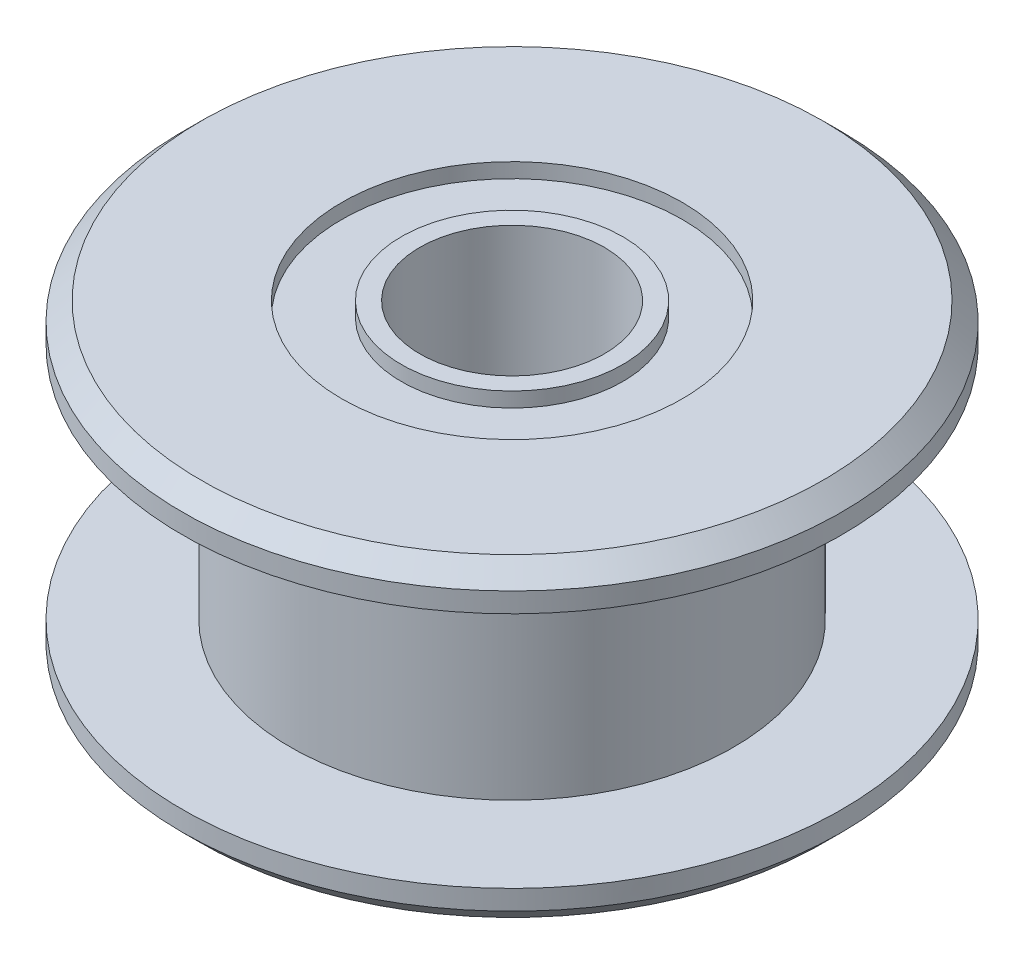
ISO-10303-21;
HEADER;
FILE_DESCRIPTION(('STEP AP214'),'2;1');
FILE_NAME('part.step','',(''),(''),'','','');
FILE_SCHEMA(('AUTOMOTIVE_DESIGN { 1 0 10303 214 1 1 1 1 }'));
ENDSEC;
DATA;
#1=APPLICATION_CONTEXT('core data for automotive mechanical design processes');
#2=APPLICATION_PROTOCOL_DEFINITION('international standard','automotive_design',2000,#1);
#3=PRODUCT_CONTEXT('',#1,'mechanical');
#4=PRODUCT('Part','Part','',(#3));
#5=PRODUCT_RELATED_PRODUCT_CATEGORY('part','',(#4));
#6=PRODUCT_DEFINITION_FORMATION('','',#4);
#7=PRODUCT_DEFINITION_CONTEXT('part definition',#1,'design');
#8=PRODUCT_DEFINITION('design','',#6,#7);
#9=PRODUCT_DEFINITION_SHAPE('','',#8);
#10=(LENGTH_UNIT() NAMED_UNIT(*) SI_UNIT(.MILLI.,.METRE.));
#11=(NAMED_UNIT(*) PLANE_ANGLE_UNIT() SI_UNIT($,.RADIAN.));
#12=(NAMED_UNIT(*) SI_UNIT($,.STERADIAN.) SOLID_ANGLE_UNIT());
#13=UNCERTAINTY_MEASURE_WITH_UNIT(LENGTH_MEASURE(1.E-05),#10,'distance_accuracy_value','');
#14=(GEOMETRIC_REPRESENTATION_CONTEXT(3) GLOBAL_UNCERTAINTY_ASSIGNED_CONTEXT((#13)) GLOBAL_UNIT_ASSIGNED_CONTEXT((#10,
#11,#12)) REPRESENTATION_CONTEXT('',''));
#15=CARTESIAN_POINT('',(0.,0.,0.));
#16=DIRECTION('',(0.,0.,1.));
#17=DIRECTION('',(1.,0.,0.));
#18=AXIS2_PLACEMENT_3D('',#15,#16,#17);
#19=CARTESIAN_POINT('',(0.,0.,0.));
#20=DIRECTION('',(0.,-1.,0.));
#21=DIRECTION('',(0.,0.,-1.));
#22=AXIS2_PLACEMENT_3D('',#19,#20,#21);
#23=CYLINDRICAL_SURFACE('',#22,4.61);
#24=CARTESIAN_POINT('',(0.,3.855,0.));
#25=DIRECTION('',(0.,-1.,0.));
#26=DIRECTION('',(0.,0.,-1.));
#27=AXIS2_PLACEMENT_3D('',#24,#25,#26);
#28=CIRCLE('',#27,4.61);
#29=CARTESIAN_POINT('',(0.,3.855,-4.61));
#30=VERTEX_POINT('',#29);
#31=EDGE_CURVE('E68',#30,#30,#28,.F.);
#32=ORIENTED_EDGE('',*,*,#31,.F.);
#33=EDGE_LOOP('',(#32));
#34=FACE_BOUND('',#33,.T.);
#35=CARTESIAN_POINT('',(0.,4.255,0.));
#36=DIRECTION('',(0.,-1.,0.));
#37=DIRECTION('',(0.,0.,-1.));
#38=AXIS2_PLACEMENT_3D('',#35,#36,#37);
#39=CIRCLE('',#38,4.61);
#40=CARTESIAN_POINT('',(0.,4.255,-4.61));
#41=VERTEX_POINT('',#40);
#42=EDGE_CURVE('E18',#41,#41,#39,.T.);
#43=ORIENTED_EDGE('',*,*,#42,.F.);
#44=EDGE_LOOP('',(#43));
#45=FACE_BOUND('',#44,.T.);
#46=ADVANCED_FACE('F15',(#34,#45),#23,.F.);
#47=CARTESIAN_POINT('',(4.61,4.255,0.));
#48=DIRECTION('',(0.,1.,0.));
#49=DIRECTION('',(0.,0.,1.));
#50=AXIS2_PLACEMENT_3D('',#47,#48,#49);
#51=PLANE('',#50);
#52=ORIENTED_EDGE('',*,*,#42,.T.);
#53=EDGE_LOOP('',(#52));
#54=FACE_BOUND('',#53,.T.);
#55=CARTESIAN_POINT('',(0.,4.255,0.));
#56=DIRECTION('',(0.,-1.,0.));
#57=DIRECTION('',(0.,0.,-1.));
#58=AXIS2_PLACEMENT_3D('',#55,#56,#57);
#59=CIRCLE('',#58,8.42499999999999);
#60=CARTESIAN_POINT('',(0.,4.255,-8.42499999999999));
#61=VERTEX_POINT('',#60);
#62=EDGE_CURVE('E66',#61,#61,#59,.T.);
#63=ORIENTED_EDGE('',*,*,#62,.F.);
#64=EDGE_LOOP('',(#63));
#65=FACE_BOUND('',#64,.T.);
#66=ADVANCED_FACE('F75',(#54,#65),#51,.T.);
#67=CARTESIAN_POINT('',(3.,3.855,0.));
#68=DIRECTION('',(0.,1.,0.));
#69=DIRECTION('',(0.,0.,1.));
#70=AXIS2_PLACEMENT_3D('',#67,#68,#69);
#71=PLANE('',#70);
#72=ORIENTED_EDGE('',*,*,#31,.T.);
#73=EDGE_LOOP('',(#72));
#74=FACE_BOUND('',#73,.T.);
#75=CARTESIAN_POINT('',(0.,3.855,0.));
#76=DIRECTION('',(0.,-1.,0.));
#77=DIRECTION('',(0.,0.,-1.));
#78=AXIS2_PLACEMENT_3D('',#75,#76,#77);
#79=CIRCLE('',#78,3.);
#80=CARTESIAN_POINT('',(0.,3.855,-3.));
#81=VERTEX_POINT('',#80);
#82=EDGE_CURVE('E63',#81,#81,#79,.F.);
#83=ORIENTED_EDGE('',*,*,#82,.F.);
#84=EDGE_LOOP('',(#83));
#85=FACE_BOUND('',#84,.T.);
#86=ADVANCED_FACE('F84',(#74,#85),#71,.T.);
#87=CARTESIAN_POINT('',(0.,3.75499999999999,0.));
#88=DIRECTION('',(0.,-1.,0.));
#89=DIRECTION('',(0.,0.,-1.));
#90=AXIS2_PLACEMENT_3D('',#87,#88,#89);
#91=CONICAL_SURFACE('',#90,8.925,0.785398163397452);
#92=ORIENTED_EDGE('',*,*,#62,.T.);
#93=EDGE_LOOP('',(#92));
#94=FACE_BOUND('',#93,.T.);
#95=CARTESIAN_POINT('',(0.,3.75499999999999,0.));
#96=DIRECTION('',(0.,-1.,0.));
#97=DIRECTION('',(0.,0.,-1.));
#98=AXIS2_PLACEMENT_3D('',#95,#96,#97);
#99=CIRCLE('',#98,8.925);
#100=CARTESIAN_POINT('',(0.,3.75499999999999,-8.925));
#101=VERTEX_POINT('',#100);
#102=EDGE_CURVE('E30',#101,#101,#99,.T.);
#103=ORIENTED_EDGE('',*,*,#102,.F.);
#104=EDGE_LOOP('',(#103));
#105=FACE_BOUND('',#104,.T.);
#106=ADVANCED_FACE('F143',(#94,#105),#91,.T.);
#107=CARTESIAN_POINT('',(0.,0.,0.));
#108=DIRECTION('',(0.,-1.,0.));
#109=DIRECTION('',(0.,0.,-1.));
#110=AXIS2_PLACEMENT_3D('',#107,#108,#109);
#111=CYLINDRICAL_SURFACE('',#110,3.);
#112=CARTESIAN_POINT('',(0.,4.255,0.));
#113=DIRECTION('',(0.,-1.,0.));
#114=DIRECTION('',(0.,0.,-1.));
#115=AXIS2_PLACEMENT_3D('',#112,#113,#114);
#116=CIRCLE('',#115,3.);
#117=CARTESIAN_POINT('',(0.,4.255,-3.));
#118=VERTEX_POINT('',#117);
#119=EDGE_CURVE('E60',#118,#118,#116,.F.);
#120=ORIENTED_EDGE('',*,*,#119,.F.);
#121=EDGE_LOOP('',(#120));
#122=FACE_BOUND('',#121,.T.);
#123=ORIENTED_EDGE('',*,*,#82,.T.);
#124=EDGE_LOOP('',(#123));
#125=FACE_BOUND('',#124,.T.);
#126=ADVANCED_FACE('F139',(#122,#125),#111,.T.);
#127=CARTESIAN_POINT('',(0.,0.,0.));
#128=DIRECTION('',(0.,-1.,0.));
#129=DIRECTION('',(0.,0.,-1.));
#130=AXIS2_PLACEMENT_3D('',#127,#128,#129);
#131=CYLINDRICAL_SURFACE('',#130,8.925);
#132=ORIENTED_EDGE('',*,*,#102,.T.);
#133=EDGE_LOOP('',(#132));
#134=FACE_BOUND('',#133,.T.);
#135=CARTESIAN_POINT('',(0.,3.22,0.));
#136=DIRECTION('',(0.,-1.,0.));
#137=DIRECTION('',(0.,0.,-1.));
#138=AXIS2_PLACEMENT_3D('',#135,#136,#137);
#139=CIRCLE('',#138,8.925);
#140=CARTESIAN_POINT('',(0.,3.22,-8.925));
#141=VERTEX_POINT('',#140);
#142=EDGE_CURVE('E57',#141,#141,#139,.T.);
#143=ORIENTED_EDGE('',*,*,#142,.F.);
#144=EDGE_LOOP('',(#143));
#145=FACE_BOUND('',#144,.T.);
#146=ADVANCED_FACE('F135',(#134,#145),#131,.T.);
#147=CARTESIAN_POINT('',(2.5,4.255,0.));
#148=DIRECTION('',(0.,1.,0.));
#149=DIRECTION('',(0.,0.,1.));
#150=AXIS2_PLACEMENT_3D('',#147,#148,#149);
#151=PLANE('',#150);
#152=ORIENTED_EDGE('',*,*,#119,.T.);
#153=EDGE_LOOP('',(#152));
#154=FACE_BOUND('',#153,.T.);
#155=CARTESIAN_POINT('',(0.,4.255,0.));
#156=DIRECTION('',(0.,-1.,0.));
#157=DIRECTION('',(0.,0.,-1.));
#158=AXIS2_PLACEMENT_3D('',#155,#156,#157);
#159=CIRCLE('',#158,2.5);
#160=CARTESIAN_POINT('',(0.,4.255,-2.5));
#161=VERTEX_POINT('',#160);
#162=EDGE_CURVE('E54',#161,#161,#159,.T.);
#163=ORIENTED_EDGE('',*,*,#162,.T.);
#164=EDGE_LOOP('',(#163));
#165=FACE_BOUND('',#164,.T.);
#166=ADVANCED_FACE('F131',(#154,#165),#151,.T.);
#167=CARTESIAN_POINT('',(8.925,3.22,0.));
#168=DIRECTION('',(0.,-1.,0.));
#169=DIRECTION('',(0.,0.,-1.));
#170=AXIS2_PLACEMENT_3D('',#167,#168,#169);
#171=PLANE('',#170);
#172=CARTESIAN_POINT('',(0.,3.22,0.));
#173=DIRECTION('',(0.,-1.,0.));
#174=DIRECTION('',(0.,0.,-1.));
#175=AXIS2_PLACEMENT_3D('',#172,#173,#174);
#176=CIRCLE('',#175,6.);
#177=CARTESIAN_POINT('',(0.,3.22,-6.));
#178=VERTEX_POINT('',#177);
#179=EDGE_CURVE('E51',#178,#178,#176,.T.);
#180=ORIENTED_EDGE('',*,*,#179,.F.);
#181=EDGE_LOOP('',(#180));
#182=FACE_BOUND('',#181,.T.);
#183=ORIENTED_EDGE('',*,*,#142,.T.);
#184=EDGE_LOOP('',(#183));
#185=FACE_BOUND('',#184,.T.);
#186=ADVANCED_FACE('F127',(#182,#185),#171,.T.);
#187=CARTESIAN_POINT('',(0.,0.,0.));
#188=DIRECTION('',(0.,-1.,0.));
#189=DIRECTION('',(0.,0.,-1.));
#190=AXIS2_PLACEMENT_3D('',#187,#188,#189);
#191=CYLINDRICAL_SURFACE('',#190,2.5);
#192=CARTESIAN_POINT('',(0.,-4.255,0.));
#193=DIRECTION('',(0.,-1.,0.));
#194=DIRECTION('',(0.,0.,-1.));
#195=AXIS2_PLACEMENT_3D('',#192,#193,#194);
#196=CIRCLE('',#195,2.5);
#197=CARTESIAN_POINT('',(0.,-4.255,-2.5));
#198=VERTEX_POINT('',#197);
#199=EDGE_CURVE('E48',#198,#198,#196,.F.);
#200=ORIENTED_EDGE('',*,*,#199,.F.);
#201=EDGE_LOOP('',(#200));
#202=FACE_BOUND('',#201,.T.);
#203=ORIENTED_EDGE('',*,*,#162,.F.);
#204=EDGE_LOOP('',(#203));
#205=FACE_BOUND('',#204,.T.);
#206=ADVANCED_FACE('F123',(#202,#205),#191,.F.);
#207=CARTESIAN_POINT('',(0.,0.,0.));
#208=DIRECTION('',(0.,-1.,0.));
#209=DIRECTION('',(0.,0.,-1.));
#210=AXIS2_PLACEMENT_3D('',#207,#208,#209);
#211=CYLINDRICAL_SURFACE('',#210,6.);
#212=ORIENTED_EDGE('',*,*,#179,.T.);
#213=EDGE_LOOP('',(#212));
#214=FACE_BOUND('',#213,.T.);
#215=CARTESIAN_POINT('',(0.,-3.22,0.));
#216=DIRECTION('',(0.,-1.,0.));
#217=DIRECTION('',(0.,0.,-1.));
#218=AXIS2_PLACEMENT_3D('',#215,#216,#217);
#219=CIRCLE('',#218,6.);
#220=CARTESIAN_POINT('',(0.,-3.22,-6.));
#221=VERTEX_POINT('',#220);
#222=EDGE_CURVE('E45',#221,#221,#219,.T.);
#223=ORIENTED_EDGE('',*,*,#222,.F.);
#224=EDGE_LOOP('',(#223));
#225=FACE_BOUND('',#224,.T.);
#226=ADVANCED_FACE('F119',(#214,#225),#211,.T.);
#227=CARTESIAN_POINT('',(2.5,-4.255,0.));
#228=DIRECTION('',(0.,-1.,0.));
#229=DIRECTION('',(0.,0.,-1.));
#230=AXIS2_PLACEMENT_3D('',#227,#228,#229);
#231=PLANE('',#230);
#232=ORIENTED_EDGE('',*,*,#199,.T.);
#233=EDGE_LOOP('',(#232));
#234=FACE_BOUND('',#233,.T.);
#235=CARTESIAN_POINT('',(0.,-4.255,0.));
#236=DIRECTION('',(0.,-1.,0.));
#237=DIRECTION('',(0.,0.,-1.));
#238=AXIS2_PLACEMENT_3D('',#235,#236,#237);
#239=CIRCLE('',#238,3.);
#240=CARTESIAN_POINT('',(0.,-4.255,-3.));
#241=VERTEX_POINT('',#240);
#242=EDGE_CURVE('E42',#241,#241,#239,.F.);
#243=ORIENTED_EDGE('',*,*,#242,.F.);
#244=EDGE_LOOP('',(#243));
#245=FACE_BOUND('',#244,.T.);
#246=ADVANCED_FACE('F115',(#234,#245),#231,.T.);
#247=CARTESIAN_POINT('',(8.925,-3.22,0.));
#248=DIRECTION('',(0.,1.,0.));
#249=DIRECTION('',(0.,0.,1.));
#250=AXIS2_PLACEMENT_3D('',#247,#248,#249);
#251=PLANE('',#250);
#252=CARTESIAN_POINT('',(0.,-3.22,0.));
#253=DIRECTION('',(0.,-1.,0.));
#254=DIRECTION('',(0.,0.,-1.));
#255=AXIS2_PLACEMENT_3D('',#252,#253,#254);
#256=CIRCLE('',#255,8.925);
#257=CARTESIAN_POINT('',(0.,-3.22,-8.925));
#258=VERTEX_POINT('',#257);
#259=EDGE_CURVE('E39',#258,#258,#256,.T.);
#260=ORIENTED_EDGE('',*,*,#259,.F.);
#261=EDGE_LOOP('',(#260));
#262=FACE_BOUND('',#261,.T.);
#263=ORIENTED_EDGE('',*,*,#222,.T.);
#264=EDGE_LOOP('',(#263));
#265=FACE_BOUND('',#264,.T.);
#266=ADVANCED_FACE('F111',(#262,#265),#251,.T.);
#267=CARTESIAN_POINT('',(0.,0.,0.));
#268=DIRECTION('',(0.,-1.,0.));
#269=DIRECTION('',(0.,0.,-1.));
#270=AXIS2_PLACEMENT_3D('',#267,#268,#269);
#271=CYLINDRICAL_SURFACE('',#270,3.);
#272=CARTESIAN_POINT('',(0.,-3.855,0.));
#273=DIRECTION('',(0.,-1.,0.));
#274=DIRECTION('',(0.,0.,-1.));
#275=AXIS2_PLACEMENT_3D('',#272,#273,#274);
#276=CIRCLE('',#275,3.);
#277=CARTESIAN_POINT('',(0.,-3.855,-3.));
#278=VERTEX_POINT('',#277);
#279=EDGE_CURVE('E36',#278,#278,#276,.F.);
#280=ORIENTED_EDGE('',*,*,#279,.F.);
#281=EDGE_LOOP('',(#280));
#282=FACE_BOUND('',#281,.T.);
#283=ORIENTED_EDGE('',*,*,#242,.T.);
#284=EDGE_LOOP('',(#283));
#285=FACE_BOUND('',#284,.T.);
#286=ADVANCED_FACE('F107',(#282,#285),#271,.T.);
#287=CARTESIAN_POINT('',(0.,0.,0.));
#288=DIRECTION('',(0.,-1.,0.));
#289=DIRECTION('',(0.,0.,-1.));
#290=AXIS2_PLACEMENT_3D('',#287,#288,#289);
#291=CYLINDRICAL_SURFACE('',#290,8.925);
#292=CARTESIAN_POINT('',(0.,-3.755,0.));
#293=DIRECTION('',(0.,1.,0.));
#294=DIRECTION('',(0.,0.,1.));
#295=AXIS2_PLACEMENT_3D('',#292,#293,#294);
#296=CIRCLE('',#295,8.925);
#297=CARTESIAN_POINT('',(0.,-3.755,8.925));
#298=VERTEX_POINT('',#297);
#299=EDGE_CURVE('E35',#298,#298,#296,.F.);
#300=ORIENTED_EDGE('',*,*,#299,.F.);
#301=EDGE_LOOP('',(#300));
#302=FACE_BOUND('',#301,.T.);
#303=ORIENTED_EDGE('',*,*,#259,.T.);
#304=EDGE_LOOP('',(#303));
#305=FACE_BOUND('',#304,.T.);
#306=ADVANCED_FACE('F103',(#302,#305),#291,.T.);
#307=CARTESIAN_POINT('',(3.,-3.855,0.));
#308=DIRECTION('',(0.,-1.,0.));
#309=DIRECTION('',(0.,0.,-1.));
#310=AXIS2_PLACEMENT_3D('',#307,#308,#309);
#311=PLANE('',#310);
#312=ORIENTED_EDGE('',*,*,#279,.T.);
#313=EDGE_LOOP('',(#312));
#314=FACE_BOUND('',#313,.T.);
#315=CARTESIAN_POINT('',(0.,-3.855,0.));
#316=DIRECTION('',(0.,-1.,0.));
#317=DIRECTION('',(0.,0.,-1.));
#318=AXIS2_PLACEMENT_3D('',#315,#316,#317);
#319=CIRCLE('',#318,4.61);
#320=CARTESIAN_POINT('',(0.,-3.855,-4.61));
#321=VERTEX_POINT('',#320);
#322=EDGE_CURVE('E27',#321,#321,#319,.T.);
#323=ORIENTED_EDGE('',*,*,#322,.T.);
#324=EDGE_LOOP('',(#323));
#325=FACE_BOUND('',#324,.T.);
#326=ADVANCED_FACE('F99',(#314,#325),#311,.T.);
#327=CARTESIAN_POINT('',(0.,-3.755,0.));
#328=DIRECTION('',(0.,1.,0.));
#329=DIRECTION('',(-1.,0.,0.));
#330=AXIS2_PLACEMENT_3D('',#327,#328,#329);
#331=CONICAL_SURFACE('',#330,8.925,0.785398163397449);
#332=ORIENTED_EDGE('',*,*,#299,.T.);
#333=EDGE_LOOP('',(#332));
#334=FACE_BOUND('',#333,.T.);
#335=CARTESIAN_POINT('',(0.,-4.255,0.));
#336=DIRECTION('',(0.,1.,0.));
#337=DIRECTION('',(-1.,0.,0.));
#338=AXIS2_PLACEMENT_3D('',#335,#336,#337);
#339=CIRCLE('',#338,8.425);
#340=CARTESIAN_POINT('',(-8.425,-4.255,0.));
#341=VERTEX_POINT('',#340);
#342=EDGE_CURVE('E22',#341,#341,#339,.F.);
#343=ORIENTED_EDGE('',*,*,#342,.F.);
#344=EDGE_LOOP('',(#343));
#345=FACE_BOUND('',#344,.T.);
#346=ADVANCED_FACE('F92',(#334,#345),#331,.T.);
#347=CARTESIAN_POINT('',(0.,0.,0.));
#348=DIRECTION('',(0.,-1.,0.));
#349=DIRECTION('',(0.,0.,-1.));
#350=AXIS2_PLACEMENT_3D('',#347,#348,#349);
#351=CYLINDRICAL_SURFACE('',#350,4.61);
#352=CARTESIAN_POINT('',(0.,-4.255,0.));
#353=DIRECTION('',(0.,-1.,0.));
#354=DIRECTION('',(0.,0.,-1.));
#355=AXIS2_PLACEMENT_3D('',#352,#353,#354);
#356=CIRCLE('',#355,4.61);
#357=CARTESIAN_POINT('',(0.,-4.255,-4.61));
#358=VERTEX_POINT('',#357);
#359=EDGE_CURVE('E10',#358,#358,#356,.F.);
#360=ORIENTED_EDGE('',*,*,#359,.F.);
#361=EDGE_LOOP('',(#360));
#362=FACE_BOUND('',#361,.T.);
#363=ORIENTED_EDGE('',*,*,#322,.F.);
#364=EDGE_LOOP('',(#363));
#365=FACE_BOUND('',#364,.T.);
#366=ADVANCED_FACE('F87',(#362,#365),#351,.F.);
#367=CARTESIAN_POINT('',(4.61,-4.255,0.));
#368=DIRECTION('',(0.,-1.,0.));
#369=DIRECTION('',(0.,0.,-1.));
#370=AXIS2_PLACEMENT_3D('',#367,#368,#369);
#371=PLANE('',#370);
#372=ORIENTED_EDGE('',*,*,#359,.T.);
#373=EDGE_LOOP('',(#372));
#374=FACE_BOUND('',#373,.T.);
#375=ORIENTED_EDGE('',*,*,#342,.T.);
#376=EDGE_LOOP('',(#375));
#377=FACE_BOUND('',#376,.T.);
#378=ADVANCED_FACE('F85',(#374,#377),#371,.T.);
#379=CLOSED_SHELL('',(#46,#66,#86,#106,#126,#146,#166,#186,#206,#226,#246,#266,#286,#306,#326,
#346,#366,#378));
#380=MANIFOLD_SOLID_BREP('B1',#379);
#381=ADVANCED_BREP_SHAPE_REPRESENTATION('',(#18,#380),#14);
#382=SHAPE_DEFINITION_REPRESENTATION(#9,#381);
ENDSEC;
END-ISO-10303-21;
